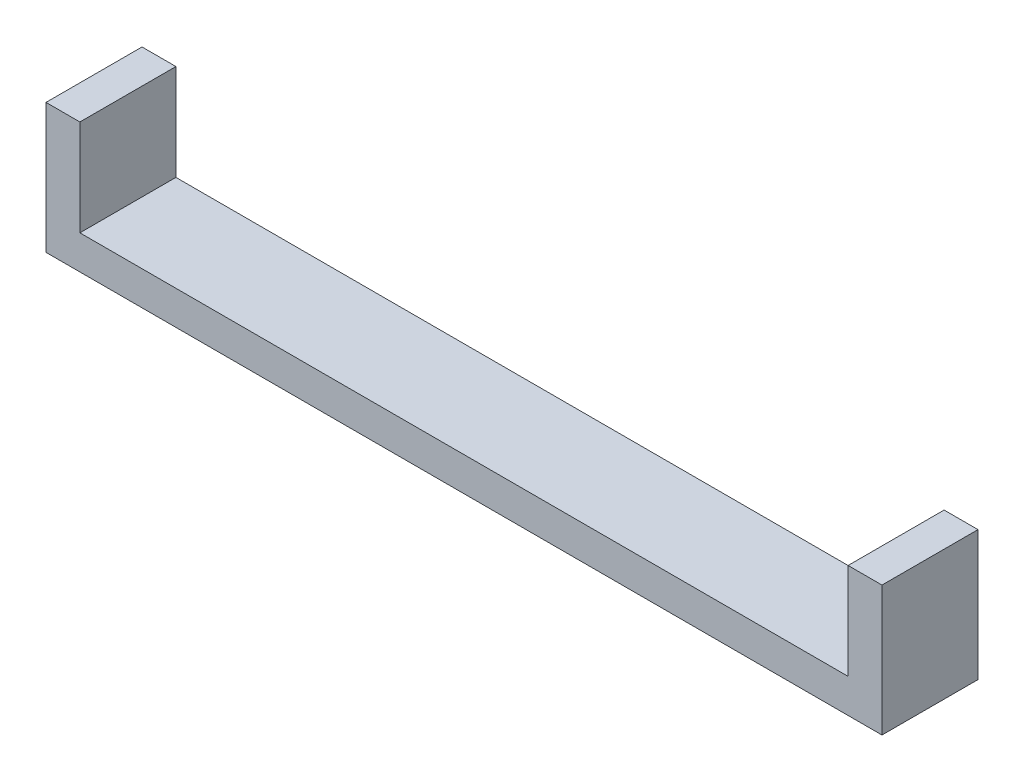
ISO-10303-21;
HEADER;
FILE_DESCRIPTION(('STEP AP214'),'2;1');
FILE_NAME('part.step','',(''),(''),'','','');
FILE_SCHEMA(('AUTOMOTIVE_DESIGN { 1 0 10303 214 1 1 1 1 }'));
ENDSEC;
DATA;
#1=APPLICATION_CONTEXT('core data for automotive mechanical design processes');
#2=APPLICATION_PROTOCOL_DEFINITION('international standard','automotive_design',2000,#1);
#3=PRODUCT_CONTEXT('',#1,'mechanical');
#4=PRODUCT('Part','Part','',(#3));
#5=PRODUCT_RELATED_PRODUCT_CATEGORY('part','',(#4));
#6=PRODUCT_DEFINITION_FORMATION('','',#4);
#7=PRODUCT_DEFINITION_CONTEXT('part definition',#1,'design');
#8=PRODUCT_DEFINITION('design','',#6,#7);
#9=PRODUCT_DEFINITION_SHAPE('','',#8);
#10=(LENGTH_UNIT() NAMED_UNIT(*) SI_UNIT(.MILLI.,.METRE.));
#11=(NAMED_UNIT(*) PLANE_ANGLE_UNIT() SI_UNIT($,.RADIAN.));
#12=(NAMED_UNIT(*) SI_UNIT($,.STERADIAN.) SOLID_ANGLE_UNIT());
#13=UNCERTAINTY_MEASURE_WITH_UNIT(LENGTH_MEASURE(1.E-05),#10,'distance_accuracy_value','');
#14=(GEOMETRIC_REPRESENTATION_CONTEXT(3) GLOBAL_UNCERTAINTY_ASSIGNED_CONTEXT((#13)) GLOBAL_UNIT_ASSIGNED_CONTEXT((#10,
#11,#12)) REPRESENTATION_CONTEXT('',''));
#15=CARTESIAN_POINT('',(0.,0.,0.));
#16=DIRECTION('',(0.,0.,1.));
#17=DIRECTION('',(1.,0.,0.));
#18=AXIS2_PLACEMENT_3D('',#15,#16,#17);
#19=CARTESIAN_POINT('',(5.,-4.25,-4.25));
#20=DIRECTION('',(0.,0.,1.));
#21=DIRECTION('',(1.,0.,0.));
#22=AXIS2_PLACEMENT_3D('',#19,#20,#21);
#23=PLANE('',#22);
#24=DIRECTION('',(1.,0.,0.));
#25=VECTOR('',#24,1.);
#26=CARTESIAN_POINT('',(-2.,-4.25,-4.25));
#27=LINE('',#26,#25);
#28=CARTESIAN_POINT('',(5.,-4.25,-4.25));
#29=VERTEX_POINT('',#28);
#30=CARTESIAN_POINT('',(73.,-4.25,-4.25));
#31=VERTEX_POINT('',#30);
#32=EDGE_CURVE('E141',#29,#31,#27,.T.);
#33=ORIENTED_EDGE('',*,*,#32,.T.);
#34=DIRECTION('',(0.,-1.,0.));
#35=VECTOR('',#34,1.);
#36=CARTESIAN_POINT('',(73.,15.2613577727726,-4.25));
#37=LINE('',#36,#35);
#38=CARTESIAN_POINT('',(73.,4.25,-4.25));
#39=VERTEX_POINT('',#38);
#40=EDGE_CURVE('E187',#39,#31,#37,.T.);
#41=ORIENTED_EDGE('',*,*,#40,.F.);
#42=DIRECTION('',(1.,0.,0.));
#43=VECTOR('',#42,1.);
#44=CARTESIAN_POINT('',(80.,4.25,-4.25));
#45=LINE('',#44,#43);
#46=CARTESIAN_POINT('',(76.,4.25,-4.25));
#47=VERTEX_POINT('',#46);
#48=EDGE_CURVE('E145',#39,#47,#45,.T.);
#49=ORIENTED_EDGE('',*,*,#48,.T.);
#50=DIRECTION('',(0.,1.,0.));
#51=VECTOR('',#50,1.);
#52=CARTESIAN_POINT('',(76.,4.25,-4.25));
#53=LINE('',#52,#51);
#54=CARTESIAN_POINT('',(76.,-7.25,-4.25));
#55=VERTEX_POINT('',#54);
#56=EDGE_CURVE('E58',#55,#47,#53,.T.);
#57=ORIENTED_EDGE('',*,*,#56,.F.);
#58=DIRECTION('',(1.,0.,0.));
#59=VECTOR('',#58,1.);
#60=CARTESIAN_POINT('',(-2.,-7.25,-4.25));
#61=LINE('',#60,#59);
#62=CARTESIAN_POINT('',(2.,-7.25,-4.25));
#63=VERTEX_POINT('',#62);
#64=EDGE_CURVE('E122',#63,#55,#61,.T.);
#65=ORIENTED_EDGE('',*,*,#64,.F.);
#66=DIRECTION('',(0.,-1.,0.));
#67=VECTOR('',#66,1.);
#68=CARTESIAN_POINT('',(2.,4.25,-4.25));
#69=LINE('',#68,#67);
#70=CARTESIAN_POINT('',(2.,4.25,-4.25));
#71=VERTEX_POINT('',#70);
#72=EDGE_CURVE('E66',#71,#63,#69,.T.);
#73=ORIENTED_EDGE('',*,*,#72,.F.);
#74=DIRECTION('',(-1.,0.,0.));
#75=VECTOR('',#74,1.);
#76=CARTESIAN_POINT('',(5.,4.25,-4.25));
#77=LINE('',#76,#75);
#78=CARTESIAN_POINT('',(5.,4.25,-4.25));
#79=VERTEX_POINT('',#78);
#80=EDGE_CURVE('E11',#79,#71,#77,.T.);
#81=ORIENTED_EDGE('',*,*,#80,.F.);
#82=DIRECTION('',(0.,1.,0.));
#83=VECTOR('',#82,1.);
#84=CARTESIAN_POINT('',(5.,-4.25,-4.25));
#85=LINE('',#84,#83);
#86=EDGE_CURVE('E130',#29,#79,#85,.T.);
#87=ORIENTED_EDGE('',*,*,#86,.F.);
#88=EDGE_LOOP('',(#33,#41,#49,#57,#65,#73,#81,#87));
#89=FACE_BOUND('',#88,.T.);
#90=ADVANCED_FACE('F43',(#89),#23,.F.);
#91=CARTESIAN_POINT('',(5.,-4.25,4.25));
#92=DIRECTION('',(0.,0.,-1.));
#93=DIRECTION('',(-1.,0.,0.));
#94=AXIS2_PLACEMENT_3D('',#91,#92,#93);
#95=PLANE('',#94);
#96=DIRECTION('',(-1.,0.,0.));
#97=VECTOR('',#96,1.);
#98=CARTESIAN_POINT('',(-2.,-7.25,4.25));
#99=LINE('',#98,#97);
#100=CARTESIAN_POINT('',(76.,-7.25,4.25));
#101=VERTEX_POINT('',#100);
#102=CARTESIAN_POINT('',(2.,-7.25,4.25));
#103=VERTEX_POINT('',#102);
#104=EDGE_CURVE('E120',#101,#103,#99,.T.);
#105=ORIENTED_EDGE('',*,*,#104,.F.);
#106=DIRECTION('',(0.,-1.,0.));
#107=VECTOR('',#106,1.);
#108=CARTESIAN_POINT('',(76.,4.25,4.25));
#109=LINE('',#108,#107);
#110=CARTESIAN_POINT('',(76.,4.25,4.25));
#111=VERTEX_POINT('',#110);
#112=EDGE_CURVE('E107',#111,#101,#109,.T.);
#113=ORIENTED_EDGE('',*,*,#112,.F.);
#114=DIRECTION('',(-1.,0.,0.));
#115=VECTOR('',#114,1.);
#116=CARTESIAN_POINT('',(80.,4.25,4.25));
#117=LINE('',#116,#115);
#118=CARTESIAN_POINT('',(73.,4.25,4.25));
#119=VERTEX_POINT('',#118);
#120=EDGE_CURVE('E181',#111,#119,#117,.T.);
#121=ORIENTED_EDGE('',*,*,#120,.T.);
#122=DIRECTION('',(0.,-1.,0.));
#123=VECTOR('',#122,1.);
#124=CARTESIAN_POINT('',(73.,15.2613577727726,4.25));
#125=LINE('',#124,#123);
#126=CARTESIAN_POINT('',(73.,-4.25,4.25));
#127=VERTEX_POINT('',#126);
#128=EDGE_CURVE('E171',#119,#127,#125,.T.);
#129=ORIENTED_EDGE('',*,*,#128,.T.);
#130=DIRECTION('',(-1.,0.,0.));
#131=VECTOR('',#130,1.);
#132=CARTESIAN_POINT('',(-2.,-4.25,4.25));
#133=LINE('',#132,#131);
#134=CARTESIAN_POINT('',(5.,-4.25,4.25));
#135=VERTEX_POINT('',#134);
#136=EDGE_CURVE('E137',#127,#135,#133,.T.);
#137=ORIENTED_EDGE('',*,*,#136,.T.);
#138=DIRECTION('',(0.,-1.,0.));
#139=VECTOR('',#138,1.);
#140=CARTESIAN_POINT('',(5.,-4.25,4.25));
#141=LINE('',#140,#139);
#142=CARTESIAN_POINT('',(5.,4.25,4.25));
#143=VERTEX_POINT('',#142);
#144=EDGE_CURVE('E150',#143,#135,#141,.T.);
#145=ORIENTED_EDGE('',*,*,#144,.F.);
#146=DIRECTION('',(-1.,0.,0.));
#147=VECTOR('',#146,1.);
#148=CARTESIAN_POINT('',(5.,4.25,4.25));
#149=LINE('',#148,#147);
#150=CARTESIAN_POINT('',(2.,4.25,4.25));
#151=VERTEX_POINT('',#150);
#152=EDGE_CURVE('E51',#143,#151,#149,.T.);
#153=ORIENTED_EDGE('',*,*,#152,.T.);
#154=DIRECTION('',(0.,1.,0.));
#155=VECTOR('',#154,1.);
#156=CARTESIAN_POINT('',(2.,4.25,4.25));
#157=LINE('',#156,#155);
#158=EDGE_CURVE('E128',#103,#151,#157,.T.);
#159=ORIENTED_EDGE('',*,*,#158,.F.);
#160=EDGE_LOOP('',(#105,#113,#121,#129,#137,#145,#153,#159));
#161=FACE_BOUND('',#160,.T.);
#162=ADVANCED_FACE('F126',(#161),#95,.F.);
#163=CARTESIAN_POINT('',(0.,-7.25,0.));
#164=DIRECTION('',(0.,-1.,0.));
#165=DIRECTION('',(0.,0.,-1.));
#166=AXIS2_PLACEMENT_3D('',#163,#164,#165);
#167=PLANE('',#166);
#168=ORIENTED_EDGE('',*,*,#64,.T.);
#169=DIRECTION('',(0.,0.,-1.));
#170=VECTOR('',#169,1.);
#171=CARTESIAN_POINT('',(76.,-7.25,4.25));
#172=LINE('',#171,#170);
#173=EDGE_CURVE('E110',#101,#55,#172,.T.);
#174=ORIENTED_EDGE('',*,*,#173,.F.);
#175=ORIENTED_EDGE('',*,*,#104,.T.);
#176=DIRECTION('',(0.,0.,1.));
#177=VECTOR('',#176,1.);
#178=CARTESIAN_POINT('',(2.,-7.25,-4.25));
#179=LINE('',#178,#177);
#180=EDGE_CURVE('E173',#63,#103,#179,.T.);
#181=ORIENTED_EDGE('',*,*,#180,.F.);
#182=EDGE_LOOP('',(#168,#174,#175,#181));
#183=FACE_BOUND('',#182,.T.);
#184=ADVANCED_FACE('F119',(#183),#167,.T.);
#185=CARTESIAN_POINT('',(5.,4.25,4.25));
#186=DIRECTION('',(0.,-1.,0.));
#187=DIRECTION('',(0.,0.,-1.));
#188=AXIS2_PLACEMENT_3D('',#185,#186,#187);
#189=PLANE('',#188);
#190=DIRECTION('',(0.,0.,1.));
#191=VECTOR('',#190,1.);
#192=CARTESIAN_POINT('',(76.,4.25,4.25));
#193=LINE('',#192,#191);
#194=EDGE_CURVE('E111',#47,#111,#193,.T.);
#195=ORIENTED_EDGE('',*,*,#194,.F.);
#196=ORIENTED_EDGE('',*,*,#48,.F.);
#197=DIRECTION('',(0.,0.,-1.));
#198=VECTOR('',#197,1.);
#199=CARTESIAN_POINT('',(73.,4.25,-4.25));
#200=LINE('',#199,#198);
#201=EDGE_CURVE('E177',#119,#39,#200,.T.);
#202=ORIENTED_EDGE('',*,*,#201,.F.);
#203=ORIENTED_EDGE('',*,*,#120,.F.);
#204=EDGE_LOOP('',(#195,#196,#202,#203));
#205=FACE_BOUND('',#204,.T.);
#206=ADVANCED_FACE('F193',(#205),#189,.F.);
#207=CARTESIAN_POINT('',(5.,4.25,4.25));
#208=DIRECTION('',(0.,-1.,0.));
#209=DIRECTION('',(0.,0.,-1.));
#210=AXIS2_PLACEMENT_3D('',#207,#208,#209);
#211=PLANE('',#210);
#212=DIRECTION('',(0.,0.,-1.));
#213=VECTOR('',#212,1.);
#214=CARTESIAN_POINT('',(2.,4.25,-4.25));
#215=LINE('',#214,#213);
#216=EDGE_CURVE('E163',#151,#71,#215,.T.);
#217=ORIENTED_EDGE('',*,*,#216,.F.);
#218=ORIENTED_EDGE('',*,*,#152,.F.);
#219=DIRECTION('',(0.,0.,1.));
#220=VECTOR('',#219,1.);
#221=CARTESIAN_POINT('',(5.,4.25,4.25));
#222=LINE('',#221,#220);
#223=EDGE_CURVE('E135',#79,#143,#222,.T.);
#224=ORIENTED_EDGE('',*,*,#223,.F.);
#225=ORIENTED_EDGE('',*,*,#80,.T.);
#226=EDGE_LOOP('',(#217,#218,#224,#225));
#227=FACE_BOUND('',#226,.T.);
#228=ADVANCED_FACE('F162',(#227),#211,.F.);
#229=CARTESIAN_POINT('',(0.,-4.25,0.));
#230=DIRECTION('',(0.,-1.,0.));
#231=DIRECTION('',(0.,0.,-1.));
#232=AXIS2_PLACEMENT_3D('',#229,#230,#231);
#233=PLANE('',#232);
#234=DIRECTION('',(0.,0.,1.));
#235=VECTOR('',#234,1.);
#236=CARTESIAN_POINT('',(73.,-4.25,-4.25));
#237=LINE('',#236,#235);
#238=EDGE_CURVE('E166',#31,#127,#237,.T.);
#239=ORIENTED_EDGE('',*,*,#238,.F.);
#240=ORIENTED_EDGE('',*,*,#32,.F.);
#241=DIRECTION('',(0.,0.,-1.));
#242=VECTOR('',#241,1.);
#243=CARTESIAN_POINT('',(5.,-4.25,4.25));
#244=LINE('',#243,#242);
#245=EDGE_CURVE('E154',#135,#29,#244,.T.);
#246=ORIENTED_EDGE('',*,*,#245,.F.);
#247=ORIENTED_EDGE('',*,*,#136,.F.);
#248=EDGE_LOOP('',(#239,#240,#246,#247));
#249=FACE_BOUND('',#248,.T.);
#250=ADVANCED_FACE('F201',(#249),#233,.F.);
#251=CARTESIAN_POINT('',(5.,0.,0.));
#252=DIRECTION('',(-1.,0.,0.));
#253=DIRECTION('',(0.,0.,1.));
#254=AXIS2_PLACEMENT_3D('',#251,#252,#253);
#255=PLANE('',#254);
#256=ORIENTED_EDGE('',*,*,#86,.T.);
#257=ORIENTED_EDGE('',*,*,#223,.T.);
#258=ORIENTED_EDGE('',*,*,#144,.T.);
#259=ORIENTED_EDGE('',*,*,#245,.T.);
#260=EDGE_LOOP('',(#256,#257,#258,#259));
#261=FACE_BOUND('',#260,.T.);
#262=ADVANCED_FACE('F204',(#261),#255,.F.);
#263=CARTESIAN_POINT('',(73.,15.2613577727726,-4.25));
#264=DIRECTION('',(1.,0.,0.));
#265=DIRECTION('',(0.,0.,-1.));
#266=AXIS2_PLACEMENT_3D('',#263,#264,#265);
#267=PLANE('',#266);
#268=ORIENTED_EDGE('',*,*,#128,.F.);
#269=ORIENTED_EDGE('',*,*,#201,.T.);
#270=ORIENTED_EDGE('',*,*,#40,.T.);
#271=ORIENTED_EDGE('',*,*,#238,.T.);
#272=EDGE_LOOP('',(#268,#269,#270,#271));
#273=FACE_BOUND('',#272,.T.);
#274=ADVANCED_FACE('F196',(#273),#267,.F.);
#275=CARTESIAN_POINT('',(2.,0.,0.));
#276=DIRECTION('',(-1.,0.,0.));
#277=DIRECTION('',(0.,0.,1.));
#278=AXIS2_PLACEMENT_3D('',#275,#276,#277);
#279=PLANE('',#278);
#280=ORIENTED_EDGE('',*,*,#158,.T.);
#281=ORIENTED_EDGE('',*,*,#216,.T.);
#282=ORIENTED_EDGE('',*,*,#72,.T.);
#283=ORIENTED_EDGE('',*,*,#180,.T.);
#284=EDGE_LOOP('',(#280,#281,#282,#283));
#285=FACE_BOUND('',#284,.T.);
#286=ADVANCED_FACE('F213',(#285),#279,.T.);
#287=CARTESIAN_POINT('',(76.,0.,0.));
#288=DIRECTION('',(1.,0.,0.));
#289=DIRECTION('',(0.,0.,-1.));
#290=AXIS2_PLACEMENT_3D('',#287,#288,#289);
#291=PLANE('',#290);
#292=ORIENTED_EDGE('',*,*,#56,.T.);
#293=ORIENTED_EDGE('',*,*,#194,.T.);
#294=ORIENTED_EDGE('',*,*,#112,.T.);
#295=ORIENTED_EDGE('',*,*,#173,.T.);
#296=EDGE_LOOP('',(#292,#293,#294,#295));
#297=FACE_BOUND('',#296,.T.);
#298=ADVANCED_FACE('F109',(#297),#291,.T.);
#299=CLOSED_SHELL('',(#90,#162,#184,#206,#228,#250,#262,#274,#286,#298));
#300=MANIFOLD_SOLID_BREP('B2',#299);
#301=ADVANCED_BREP_SHAPE_REPRESENTATION('',(#18,#300),#14);
#302=SHAPE_DEFINITION_REPRESENTATION(#9,#301);
ENDSEC;
END-ISO-10303-21;
